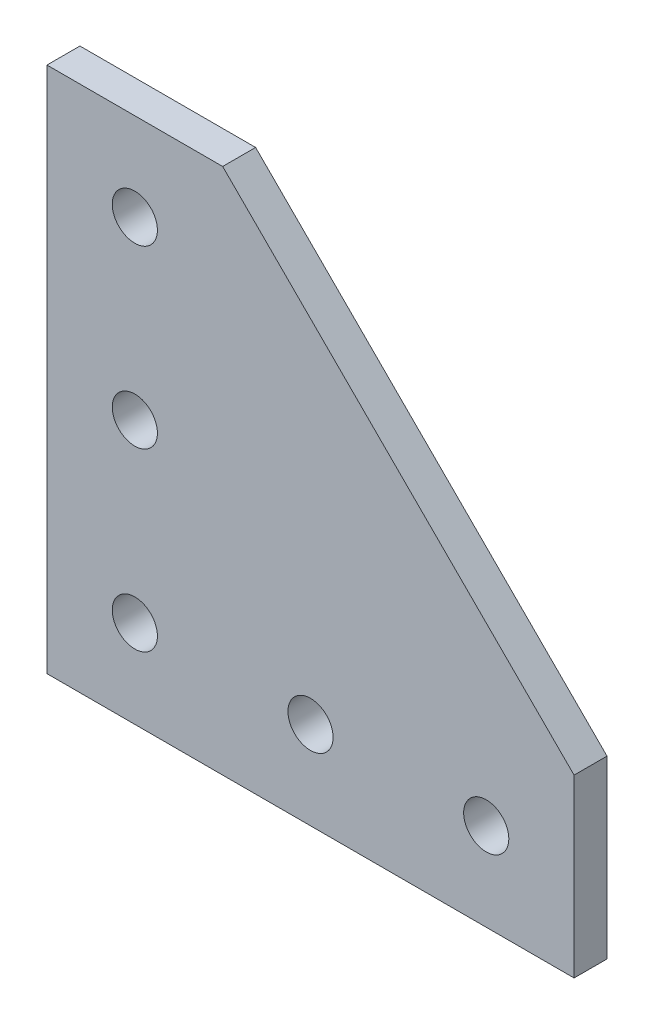
ISO-10303-21;
HEADER;
FILE_DESCRIPTION(('STEP AP214'),'2;1');
FILE_NAME('part.step','',(''),(''),'','','');
FILE_SCHEMA(('AUTOMOTIVE_DESIGN { 1 0 10303 214 1 1 1 1 }'));
ENDSEC;
DATA;
#1=APPLICATION_CONTEXT('core data for automotive mechanical design processes');
#2=APPLICATION_PROTOCOL_DEFINITION('international standard','automotive_design',2000,#1);
#3=PRODUCT_CONTEXT('',#1,'mechanical');
#4=PRODUCT('Part','Part','',(#3));
#5=PRODUCT_RELATED_PRODUCT_CATEGORY('part','',(#4));
#6=PRODUCT_DEFINITION_FORMATION('','',#4);
#7=PRODUCT_DEFINITION_CONTEXT('part definition',#1,'design');
#8=PRODUCT_DEFINITION('design','',#6,#7);
#9=PRODUCT_DEFINITION_SHAPE('','',#8);
#10=(LENGTH_UNIT() NAMED_UNIT(*) SI_UNIT(.MILLI.,.METRE.));
#11=(NAMED_UNIT(*) PLANE_ANGLE_UNIT() SI_UNIT($,.RADIAN.));
#12=(NAMED_UNIT(*) SI_UNIT($,.STERADIAN.) SOLID_ANGLE_UNIT());
#13=UNCERTAINTY_MEASURE_WITH_UNIT(LENGTH_MEASURE(1.E-05),#10,'distance_accuracy_value','');
#14=(GEOMETRIC_REPRESENTATION_CONTEXT(3) GLOBAL_UNCERTAINTY_ASSIGNED_CONTEXT((#13)) GLOBAL_UNIT_ASSIGNED_CONTEXT((#10,
#11,#12)) REPRESENTATION_CONTEXT('',''));
#15=CARTESIAN_POINT('',(0.,0.,0.));
#16=DIRECTION('',(0.,0.,1.));
#17=DIRECTION('',(1.,0.,0.));
#18=AXIS2_PLACEMENT_3D('',#15,#16,#17);
#19=CARTESIAN_POINT('',(0.,0.,2.38125));
#20=DIRECTION('',(0.,0.,-1.));
#21=DIRECTION('',(-1.,0.,0.));
#22=AXIS2_PLACEMENT_3D('',#19,#20,#21);
#23=PLANE('',#22);
#24=DIRECTION('',(1.,0.,0.));
#25=VECTOR('',#24,1.);
#26=CARTESIAN_POINT('',(76.2,0.,2.38125));
#27=LINE('',#26,#25);
#28=CARTESIAN_POINT('',(0.,0.,2.38125));
#29=VERTEX_POINT('',#28);
#30=CARTESIAN_POINT('',(76.2,0.,2.38125));
#31=VERTEX_POINT('',#30);
#32=EDGE_CURVE('E119',#29,#31,#27,.T.);
#33=ORIENTED_EDGE('',*,*,#32,.T.);
#34=DIRECTION('',(0.,1.,0.));
#35=VECTOR('',#34,1.);
#36=CARTESIAN_POINT('',(76.2,25.4,2.38125));
#37=LINE('',#36,#35);
#38=CARTESIAN_POINT('',(76.2,25.4,2.38125));
#39=VERTEX_POINT('',#38);
#40=EDGE_CURVE('E86',#31,#39,#37,.T.);
#41=ORIENTED_EDGE('',*,*,#40,.T.);
#42=DIRECTION('',(-0.707106781186547,0.707106781186547,0.));
#43=VECTOR('',#42,1.);
#44=CARTESIAN_POINT('',(76.2,25.4,2.38125));
#45=LINE('',#44,#43);
#46=CARTESIAN_POINT('',(25.4,76.2,2.38125));
#47=VERTEX_POINT('',#46);
#48=EDGE_CURVE('E90',#39,#47,#45,.T.);
#49=ORIENTED_EDGE('',*,*,#48,.T.);
#50=DIRECTION('',(-1.,0.,0.));
#51=VECTOR('',#50,1.);
#52=CARTESIAN_POINT('',(0.,76.2,2.38125));
#53=LINE('',#52,#51);
#54=CARTESIAN_POINT('',(0.,76.2,2.38125));
#55=VERTEX_POINT('',#54);
#56=EDGE_CURVE('E94',#47,#55,#53,.T.);
#57=ORIENTED_EDGE('',*,*,#56,.T.);
#58=DIRECTION('',(0.,-1.,0.));
#59=VECTOR('',#58,1.);
#60=CARTESIAN_POINT('',(0.,0.,2.38125));
#61=LINE('',#60,#59);
#62=EDGE_CURVE('E52',#55,#29,#61,.T.);
#63=ORIENTED_EDGE('',*,*,#62,.T.);
#64=EDGE_LOOP('',(#33,#41,#49,#57,#63));
#65=FACE_BOUND('',#64,.T.);
#66=CARTESIAN_POINT('',(12.7,12.7,2.38125));
#67=DIRECTION('',(0.,0.,1.));
#68=DIRECTION('',(1.,0.,0.));
#69=AXIS2_PLACEMENT_3D('',#66,#67,#68);
#70=CIRCLE('',#69,3.2639);
#71=CARTESIAN_POINT('',(15.9639,12.7,2.38125));
#72=VERTEX_POINT('',#71);
#73=EDGE_CURVE('E114',#72,#72,#70,.T.);
#74=ORIENTED_EDGE('',*,*,#73,.F.);
#75=EDGE_LOOP('',(#74));
#76=FACE_BOUND('',#75,.T.);
#77=CARTESIAN_POINT('',(38.1,12.7,2.38125));
#78=DIRECTION('',(0.,0.,1.));
#79=DIRECTION('',(1.,0.,0.));
#80=AXIS2_PLACEMENT_3D('',#77,#78,#79);
#81=CIRCLE('',#80,3.26389999999999);
#82=CARTESIAN_POINT('',(41.3639,12.7,2.38125));
#83=VERTEX_POINT('',#82);
#84=EDGE_CURVE('E188',#83,#83,#81,.T.);
#85=ORIENTED_EDGE('',*,*,#84,.F.);
#86=EDGE_LOOP('',(#85));
#87=FACE_BOUND('',#86,.T.);
#88=CARTESIAN_POINT('',(63.5,12.7,2.38125));
#89=DIRECTION('',(0.,0.,1.));
#90=DIRECTION('',(1.,0.,0.));
#91=AXIS2_PLACEMENT_3D('',#88,#89,#90);
#92=CIRCLE('',#91,3.26389999999999);
#93=CARTESIAN_POINT('',(66.7639,12.7,2.38125));
#94=VERTEX_POINT('',#93);
#95=EDGE_CURVE('E182',#94,#94,#92,.T.);
#96=ORIENTED_EDGE('',*,*,#95,.F.);
#97=EDGE_LOOP('',(#96));
#98=FACE_BOUND('',#97,.T.);
#99=CARTESIAN_POINT('',(12.7,63.5,2.38125));
#100=DIRECTION('',(0.,0.,1.));
#101=DIRECTION('',(1.,0.,0.));
#102=AXIS2_PLACEMENT_3D('',#99,#100,#101);
#103=CIRCLE('',#102,3.2639);
#104=CARTESIAN_POINT('',(15.9639,63.5,2.38125));
#105=VERTEX_POINT('',#104);
#106=EDGE_CURVE('E176',#105,#105,#103,.T.);
#107=ORIENTED_EDGE('',*,*,#106,.F.);
#108=EDGE_LOOP('',(#107));
#109=FACE_BOUND('',#108,.T.);
#110=CARTESIAN_POINT('',(12.7,38.1,2.38125));
#111=DIRECTION('',(0.,0.,1.));
#112=DIRECTION('',(1.,0.,0.));
#113=AXIS2_PLACEMENT_3D('',#110,#111,#112);
#114=CIRCLE('',#113,3.26389999999999);
#115=CARTESIAN_POINT('',(15.9639,38.1,2.38125));
#116=VERTEX_POINT('',#115);
#117=EDGE_CURVE('E167',#116,#116,#114,.T.);
#118=ORIENTED_EDGE('',*,*,#117,.F.);
#119=EDGE_LOOP('',(#118));
#120=FACE_BOUND('',#119,.T.);
#121=ADVANCED_FACE('F35',(#65,#76,#87,#98,#109,#120),#23,.F.);
#122=CARTESIAN_POINT('',(0.,0.,-2.38125));
#123=DIRECTION('',(0.,0.,-1.));
#124=DIRECTION('',(-1.,0.,0.));
#125=AXIS2_PLACEMENT_3D('',#122,#123,#124);
#126=PLANE('',#125);
#127=CARTESIAN_POINT('',(12.7,63.5,-2.38125));
#128=DIRECTION('',(0.,0.,1.));
#129=DIRECTION('',(1.,0.,0.));
#130=AXIS2_PLACEMENT_3D('',#127,#128,#129);
#131=CIRCLE('',#130,3.2639);
#132=CARTESIAN_POINT('',(15.9639,63.5,-2.38125));
#133=VERTEX_POINT('',#132);
#134=EDGE_CURVE('E173',#133,#133,#131,.T.);
#135=ORIENTED_EDGE('',*,*,#134,.T.);
#136=EDGE_LOOP('',(#135));
#137=FACE_BOUND('',#136,.T.);
#138=CARTESIAN_POINT('',(38.1,12.7,-2.38125));
#139=DIRECTION('',(0.,0.,1.));
#140=DIRECTION('',(1.,0.,0.));
#141=AXIS2_PLACEMENT_3D('',#138,#139,#140);
#142=CIRCLE('',#141,3.26389999999999);
#143=CARTESIAN_POINT('',(41.3639,12.7,-2.38125));
#144=VERTEX_POINT('',#143);
#145=EDGE_CURVE('E185',#144,#144,#142,.T.);
#146=ORIENTED_EDGE('',*,*,#145,.T.);
#147=EDGE_LOOP('',(#146));
#148=FACE_BOUND('',#147,.T.);
#149=DIRECTION('',(1.,0.,0.));
#150=VECTOR('',#149,1.);
#151=CARTESIAN_POINT('',(76.2,0.,-2.38125));
#152=LINE('',#151,#150);
#153=CARTESIAN_POINT('',(0.,0.,-2.38125));
#154=VERTEX_POINT('',#153);
#155=CARTESIAN_POINT('',(76.2,0.,-2.38125));
#156=VERTEX_POINT('',#155);
#157=EDGE_CURVE('E110',#154,#156,#152,.T.);
#158=ORIENTED_EDGE('',*,*,#157,.F.);
#159=DIRECTION('',(0.,-1.,0.));
#160=VECTOR('',#159,1.);
#161=CARTESIAN_POINT('',(0.,0.,-2.38125));
#162=LINE('',#161,#160);
#163=CARTESIAN_POINT('',(0.,76.2,-2.38125));
#164=VERTEX_POINT('',#163);
#165=EDGE_CURVE('E78',#164,#154,#162,.T.);
#166=ORIENTED_EDGE('',*,*,#165,.F.);
#167=DIRECTION('',(-1.,0.,0.));
#168=VECTOR('',#167,1.);
#169=CARTESIAN_POINT('',(0.,76.2,-2.38125));
#170=LINE('',#169,#168);
#171=CARTESIAN_POINT('',(25.4,76.2,-2.38125));
#172=VERTEX_POINT('',#171);
#173=EDGE_CURVE('E72',#172,#164,#170,.T.);
#174=ORIENTED_EDGE('',*,*,#173,.F.);
#175=DIRECTION('',(-0.707106781186547,0.707106781186547,0.));
#176=VECTOR('',#175,1.);
#177=CARTESIAN_POINT('',(76.2,25.4,-2.38125));
#178=LINE('',#177,#176);
#179=CARTESIAN_POINT('',(76.2,25.4,-2.38125));
#180=VERTEX_POINT('',#179);
#181=EDGE_CURVE('E101',#180,#172,#178,.T.);
#182=ORIENTED_EDGE('',*,*,#181,.F.);
#183=DIRECTION('',(0.,1.,0.));
#184=VECTOR('',#183,1.);
#185=CARTESIAN_POINT('',(76.2,25.4,-2.38125));
#186=LINE('',#185,#184);
#187=EDGE_CURVE('E113',#156,#180,#186,.T.);
#188=ORIENTED_EDGE('',*,*,#187,.F.);
#189=EDGE_LOOP('',(#158,#166,#174,#182,#188));
#190=FACE_BOUND('',#189,.T.);
#191=CARTESIAN_POINT('',(12.7,12.7,-2.38125));
#192=DIRECTION('',(0.,0.,1.));
#193=DIRECTION('',(1.,0.,0.));
#194=AXIS2_PLACEMENT_3D('',#191,#192,#193);
#195=CIRCLE('',#194,3.2639);
#196=CARTESIAN_POINT('',(15.9639,12.7,-2.38125));
#197=VERTEX_POINT('',#196);
#198=EDGE_CURVE('E191',#197,#197,#195,.T.);
#199=ORIENTED_EDGE('',*,*,#198,.T.);
#200=EDGE_LOOP('',(#199));
#201=FACE_BOUND('',#200,.T.);
#202=CARTESIAN_POINT('',(63.5,12.7,-2.38125));
#203=DIRECTION('',(0.,0.,1.));
#204=DIRECTION('',(1.,0.,0.));
#205=AXIS2_PLACEMENT_3D('',#202,#203,#204);
#206=CIRCLE('',#205,3.26389999999999);
#207=CARTESIAN_POINT('',(66.7639,12.7,-2.38125));
#208=VERTEX_POINT('',#207);
#209=EDGE_CURVE('E179',#208,#208,#206,.T.);
#210=ORIENTED_EDGE('',*,*,#209,.T.);
#211=EDGE_LOOP('',(#210));
#212=FACE_BOUND('',#211,.T.);
#213=CARTESIAN_POINT('',(12.7,38.1,-2.38125));
#214=DIRECTION('',(0.,0.,1.));
#215=DIRECTION('',(1.,0.,0.));
#216=AXIS2_PLACEMENT_3D('',#213,#214,#215);
#217=CIRCLE('',#216,3.26389999999999);
#218=CARTESIAN_POINT('',(15.9639,38.1,-2.38125));
#219=VERTEX_POINT('',#218);
#220=EDGE_CURVE('E170',#219,#219,#217,.T.);
#221=ORIENTED_EDGE('',*,*,#220,.T.);
#222=EDGE_LOOP('',(#221));
#223=FACE_BOUND('',#222,.T.);
#224=ADVANCED_FACE('F123',(#137,#148,#190,#201,#212,#223),#126,.T.);
#225=CARTESIAN_POINT('',(76.2,0.,2.38125));
#226=DIRECTION('',(0.,1.,0.));
#227=DIRECTION('',(-1.,0.,0.));
#228=AXIS2_PLACEMENT_3D('',#225,#226,#227);
#229=PLANE('',#228);
#230=ORIENTED_EDGE('',*,*,#157,.T.);
#231=DIRECTION('',(0.,0.,-1.));
#232=VECTOR('',#231,1.);
#233=CARTESIAN_POINT('',(76.2,0.,2.38125));
#234=LINE('',#233,#232);
#235=EDGE_CURVE('E11',#31,#156,#234,.T.);
#236=ORIENTED_EDGE('',*,*,#235,.F.);
#237=ORIENTED_EDGE('',*,*,#32,.F.);
#238=DIRECTION('',(0.,0.,-1.));
#239=VECTOR('',#238,1.);
#240=CARTESIAN_POINT('',(0.,0.,2.38125));
#241=LINE('',#240,#239);
#242=EDGE_CURVE('E106',#29,#154,#241,.T.);
#243=ORIENTED_EDGE('',*,*,#242,.T.);
#244=EDGE_LOOP('',(#230,#236,#237,#243));
#245=FACE_BOUND('',#244,.T.);
#246=ADVANCED_FACE('F37',(#245),#229,.F.);
#247=CARTESIAN_POINT('',(76.2,25.4,2.38125));
#248=DIRECTION('',(-1.,0.,0.));
#249=DIRECTION('',(0.,0.,1.));
#250=AXIS2_PLACEMENT_3D('',#247,#248,#249);
#251=PLANE('',#250);
#252=ORIENTED_EDGE('',*,*,#187,.T.);
#253=DIRECTION('',(0.,0.,-1.));
#254=VECTOR('',#253,1.);
#255=CARTESIAN_POINT('',(76.2,25.4,2.38125));
#256=LINE('',#255,#254);
#257=EDGE_CURVE('E44',#39,#180,#256,.T.);
#258=ORIENTED_EDGE('',*,*,#257,.F.);
#259=ORIENTED_EDGE('',*,*,#40,.F.);
#260=ORIENTED_EDGE('',*,*,#235,.T.);
#261=EDGE_LOOP('',(#252,#258,#259,#260));
#262=FACE_BOUND('',#261,.T.);
#263=ADVANCED_FACE('F251',(#262),#251,.F.);
#264=CARTESIAN_POINT('',(76.2,25.4,2.38125));
#265=DIRECTION('',(-0.707106781186547,-0.707106781186547,0.));
#266=DIRECTION('',(0.707106781186548,-0.707106781186548,0.));
#267=AXIS2_PLACEMENT_3D('',#264,#265,#266);
#268=PLANE('',#267);
#269=ORIENTED_EDGE('',*,*,#181,.T.);
#270=DIRECTION('',(0.,0.,-1.));
#271=VECTOR('',#270,1.);
#272=CARTESIAN_POINT('',(25.4,76.2,2.38125));
#273=LINE('',#272,#271);
#274=EDGE_CURVE('E98',#47,#172,#273,.T.);
#275=ORIENTED_EDGE('',*,*,#274,.F.);
#276=ORIENTED_EDGE('',*,*,#48,.F.);
#277=ORIENTED_EDGE('',*,*,#257,.T.);
#278=EDGE_LOOP('',(#269,#275,#276,#277));
#279=FACE_BOUND('',#278,.T.);
#280=ADVANCED_FACE('F99',(#279),#268,.F.);
#281=CARTESIAN_POINT('',(0.,76.2,2.38125));
#282=DIRECTION('',(0.,-1.,0.));
#283=DIRECTION('',(0.,0.,-1.));
#284=AXIS2_PLACEMENT_3D('',#281,#282,#283);
#285=PLANE('',#284);
#286=ORIENTED_EDGE('',*,*,#173,.T.);
#287=DIRECTION('',(0.,0.,-1.));
#288=VECTOR('',#287,1.);
#289=CARTESIAN_POINT('',(0.,76.2,2.38125));
#290=LINE('',#289,#288);
#291=EDGE_CURVE('E102',#55,#164,#290,.T.);
#292=ORIENTED_EDGE('',*,*,#291,.F.);
#293=ORIENTED_EDGE('',*,*,#56,.F.);
#294=ORIENTED_EDGE('',*,*,#274,.T.);
#295=EDGE_LOOP('',(#286,#292,#293,#294));
#296=FACE_BOUND('',#295,.T.);
#297=ADVANCED_FACE('F104',(#296),#285,.F.);
#298=CARTESIAN_POINT('',(0.,0.,2.38125));
#299=DIRECTION('',(1.,0.,0.));
#300=DIRECTION('',(0.,0.,-1.));
#301=AXIS2_PLACEMENT_3D('',#298,#299,#300);
#302=PLANE('',#301);
#303=ORIENTED_EDGE('',*,*,#165,.T.);
#304=ORIENTED_EDGE('',*,*,#242,.F.);
#305=ORIENTED_EDGE('',*,*,#62,.F.);
#306=ORIENTED_EDGE('',*,*,#291,.T.);
#307=EDGE_LOOP('',(#303,#304,#305,#306));
#308=FACE_BOUND('',#307,.T.);
#309=ADVANCED_FACE('F128',(#308),#302,.F.);
#310=CARTESIAN_POINT('',(12.7,12.7,2.38125));
#311=DIRECTION('',(0.,0.,-1.));
#312=DIRECTION('',(-1.,0.,0.));
#313=AXIS2_PLACEMENT_3D('',#310,#311,#312);
#314=CYLINDRICAL_SURFACE('',#313,3.2639);
#315=ORIENTED_EDGE('',*,*,#73,.T.);
#316=EDGE_LOOP('',(#315));
#317=FACE_BOUND('',#316,.T.);
#318=ORIENTED_EDGE('',*,*,#198,.F.);
#319=EDGE_LOOP('',(#318));
#320=FACE_BOUND('',#319,.T.);
#321=ADVANCED_FACE('F130',(#317,#320),#314,.F.);
#322=CARTESIAN_POINT('',(38.1,12.7,2.38125));
#323=DIRECTION('',(0.,0.,-1.));
#324=DIRECTION('',(-1.,0.,0.));
#325=AXIS2_PLACEMENT_3D('',#322,#323,#324);
#326=CYLINDRICAL_SURFACE('',#325,3.26389999999999);
#327=ORIENTED_EDGE('',*,*,#84,.T.);
#328=EDGE_LOOP('',(#327));
#329=FACE_BOUND('',#328,.T.);
#330=ORIENTED_EDGE('',*,*,#145,.F.);
#331=EDGE_LOOP('',(#330));
#332=FACE_BOUND('',#331,.T.);
#333=ADVANCED_FACE('F136',(#329,#332),#326,.F.);
#334=CARTESIAN_POINT('',(63.5,12.7,2.38125));
#335=DIRECTION('',(0.,0.,-1.));
#336=DIRECTION('',(-1.,0.,0.));
#337=AXIS2_PLACEMENT_3D('',#334,#335,#336);
#338=CYLINDRICAL_SURFACE('',#337,3.26389999999999);
#339=ORIENTED_EDGE('',*,*,#95,.T.);
#340=EDGE_LOOP('',(#339));
#341=FACE_BOUND('',#340,.T.);
#342=ORIENTED_EDGE('',*,*,#209,.F.);
#343=EDGE_LOOP('',(#342));
#344=FACE_BOUND('',#343,.T.);
#345=ADVANCED_FACE('F150',(#341,#344),#338,.F.);
#346=CARTESIAN_POINT('',(12.7,63.5,2.38125));
#347=DIRECTION('',(0.,0.,-1.));
#348=DIRECTION('',(-1.,0.,0.));
#349=AXIS2_PLACEMENT_3D('',#346,#347,#348);
#350=CYLINDRICAL_SURFACE('',#349,3.2639);
#351=ORIENTED_EDGE('',*,*,#106,.T.);
#352=EDGE_LOOP('',(#351));
#353=FACE_BOUND('',#352,.T.);
#354=ORIENTED_EDGE('',*,*,#134,.F.);
#355=EDGE_LOOP('',(#354));
#356=FACE_BOUND('',#355,.T.);
#357=ADVANCED_FACE('F154',(#353,#356),#350,.F.);
#358=CARTESIAN_POINT('',(12.7,38.1,2.38125));
#359=DIRECTION('',(0.,0.,-1.));
#360=DIRECTION('',(-1.,0.,0.));
#361=AXIS2_PLACEMENT_3D('',#358,#359,#360);
#362=CYLINDRICAL_SURFACE('',#361,3.26389999999999);
#363=ORIENTED_EDGE('',*,*,#117,.T.);
#364=EDGE_LOOP('',(#363));
#365=FACE_BOUND('',#364,.T.);
#366=ORIENTED_EDGE('',*,*,#220,.F.);
#367=EDGE_LOOP('',(#366));
#368=FACE_BOUND('',#367,.T.);
#369=ADVANCED_FACE('F158',(#365,#368),#362,.F.);
#370=CLOSED_SHELL('',(#121,#224,#246,#263,#280,#297,#309,#321,#333,#345,#357,#369));
#371=MANIFOLD_SOLID_BREP('B2',#370);
#372=ADVANCED_BREP_SHAPE_REPRESENTATION('',(#18,#371),#14);
#373=SHAPE_DEFINITION_REPRESENTATION(#9,#372);
ENDSEC;
END-ISO-10303-21;
